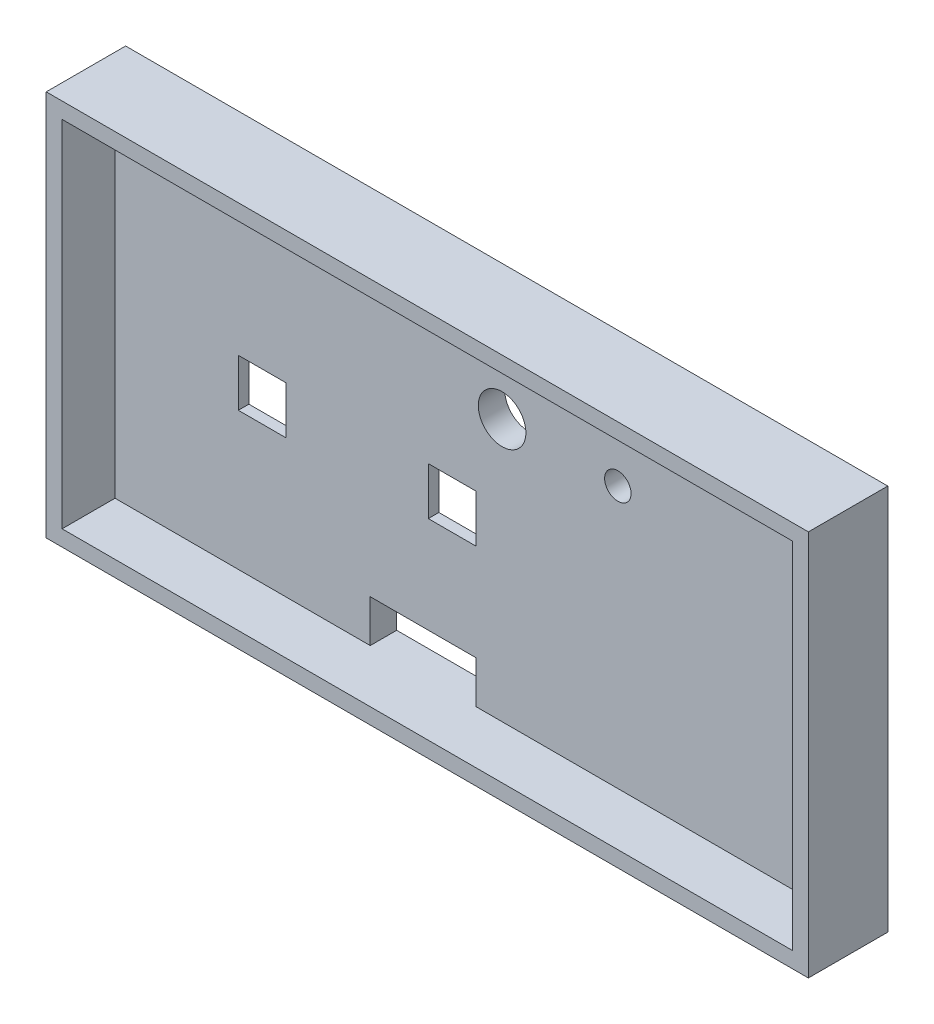
ISO-10303-21;
HEADER;
FILE_DESCRIPTION(('STEP AP214'),'2;1');
FILE_NAME('part.step','',(''),(''),'','','');
FILE_SCHEMA(('AUTOMOTIVE_DESIGN { 1 0 10303 214 1 1 1 1 }'));
ENDSEC;
DATA;
#1=APPLICATION_CONTEXT('core data for automotive mechanical design processes');
#2=APPLICATION_PROTOCOL_DEFINITION('international standard','automotive_design',2000,#1);
#3=PRODUCT_CONTEXT('',#1,'mechanical');
#4=PRODUCT('Part','Part','',(#3));
#5=PRODUCT_RELATED_PRODUCT_CATEGORY('part','',(#4));
#6=PRODUCT_DEFINITION_FORMATION('','',#4);
#7=PRODUCT_DEFINITION_CONTEXT('part definition',#1,'design');
#8=PRODUCT_DEFINITION('design','',#6,#7);
#9=PRODUCT_DEFINITION_SHAPE('','',#8);
#10=(LENGTH_UNIT() NAMED_UNIT(*) SI_UNIT(.MILLI.,.METRE.));
#11=(NAMED_UNIT(*) PLANE_ANGLE_UNIT() SI_UNIT($,.RADIAN.));
#12=(NAMED_UNIT(*) SI_UNIT($,.STERADIAN.) SOLID_ANGLE_UNIT());
#13=UNCERTAINTY_MEASURE_WITH_UNIT(LENGTH_MEASURE(1.E-05),#10,'distance_accuracy_value','');
#14=(GEOMETRIC_REPRESENTATION_CONTEXT(3) GLOBAL_UNCERTAINTY_ASSIGNED_CONTEXT((#13)) GLOBAL_UNIT_ASSIGNED_CONTEXT((#10,
#11,#12)) REPRESENTATION_CONTEXT('',''));
#15=CARTESIAN_POINT('',(0.,0.,0.));
#16=DIRECTION('',(0.,0.,1.));
#17=DIRECTION('',(1.,0.,0.));
#18=AXIS2_PLACEMENT_3D('',#15,#16,#17);
#19=CARTESIAN_POINT('',(0.,0.,5.));
#20=DIRECTION('',(0.,0.,-1.));
#21=DIRECTION('',(-1.,0.,0.));
#22=AXIS2_PLACEMENT_3D('',#19,#20,#21);
#23=PLANE('',#22);
#24=CARTESIAN_POINT('',(69.1285466758129,52.5065249926504,5.));
#25=DIRECTION('',(0.,0.,-1.));
#26=DIRECTION('',(-1.,0.,0.));
#27=AXIS2_PLACEMENT_3D('',#24,#25,#26);
#28=CIRCLE('',#27,4.50000000000001);
#29=CARTESIAN_POINT('',(64.6285466758129,52.5065249926504,5.));
#30=VERTEX_POINT('',#29);
#31=EDGE_CURVE('E422',#30,#30,#28,.T.);
#32=ORIENTED_EDGE('',*,*,#31,.T.);
#33=EDGE_LOOP('',(#32));
#34=FACE_BOUND('',#33,.T.);
#35=DIRECTION('',(-1.,0.,0.));
#36=VECTOR('',#35,1.);
#37=CARTESIAN_POINT('',(28.2933870874081,38.0413654042455,5.));
#38=LINE('',#37,#36);
#39=CARTESIAN_POINT('',(28.2933870874081,38.0413654042455,5.));
#40=VERTEX_POINT('',#39);
#41=CARTESIAN_POINT('',(19.293387087408,38.0413654042456,5.));
#42=VERTEX_POINT('',#41);
#43=EDGE_CURVE('E402',#40,#42,#38,.T.);
#44=ORIENTED_EDGE('',*,*,#43,.F.);
#45=DIRECTION('',(0.,1.,0.));
#46=VECTOR('',#45,1.);
#47=CARTESIAN_POINT('',(28.2933870874081,38.0413654042455,5.));
#48=LINE('',#47,#46);
#49=CARTESIAN_POINT('',(28.293387087408,29.0413654042456,5.));
#50=VERTEX_POINT('',#49);
#51=EDGE_CURVE('E399',#50,#40,#48,.T.);
#52=ORIENTED_EDGE('',*,*,#51,.F.);
#53=DIRECTION('',(1.,0.,0.));
#54=VECTOR('',#53,1.);
#55=CARTESIAN_POINT('',(28.293387087408,29.0413654042456,5.));
#56=LINE('',#55,#54);
#57=CARTESIAN_POINT('',(19.293387087408,29.0413654042456,5.));
#58=VERTEX_POINT('',#57);
#59=EDGE_CURVE('E408',#58,#50,#56,.T.);
#60=ORIENTED_EDGE('',*,*,#59,.F.);
#61=DIRECTION('',(0.,-1.,0.));
#62=VECTOR('',#61,1.);
#63=CARTESIAN_POINT('',(19.293387087408,38.0413654042456,5.));
#64=LINE('',#63,#62);
#65=EDGE_CURVE('E405',#42,#58,#64,.T.);
#66=ORIENTED_EDGE('',*,*,#65,.F.);
#67=EDGE_LOOP('',(#44,#52,#60,#66));
#68=FACE_BOUND('',#67,.T.);
#69=DIRECTION('',(1.,0.,0.));
#70=VECTOR('',#69,1.);
#71=CARTESIAN_POINT('',(0.,38.2637078079074,5.));
#72=LINE('',#71,#70);
#73=CARTESIAN_POINT('',(55.1883659810974,38.2637078079074,5.));
#74=VERTEX_POINT('',#73);
#75=CARTESIAN_POINT('',(64.1883659810974,38.2637078079074,5.));
#76=VERTEX_POINT('',#75);
#77=EDGE_CURVE('E451',#74,#76,#72,.T.);
#78=ORIENTED_EDGE('',*,*,#77,.T.);
#79=DIRECTION('',(0.,-1.,0.));
#80=VECTOR('',#79,1.);
#81=CARTESIAN_POINT('',(64.1883659810974,0.,5.));
#82=LINE('',#81,#80);
#83=CARTESIAN_POINT('',(64.1883659810974,29.2637078079074,5.));
#84=VERTEX_POINT('',#83);
#85=EDGE_CURVE('E49',#76,#84,#82,.T.);
#86=ORIENTED_EDGE('',*,*,#85,.T.);
#87=DIRECTION('',(-1.,0.,0.));
#88=VECTOR('',#87,1.);
#89=CARTESIAN_POINT('',(0.,29.2637078079074,5.));
#90=LINE('',#89,#88);
#91=CARTESIAN_POINT('',(55.1883659810974,29.2637078079074,5.));
#92=VERTEX_POINT('',#91);
#93=EDGE_CURVE('E445',#84,#92,#90,.T.);
#94=ORIENTED_EDGE('',*,*,#93,.T.);
#95=DIRECTION('',(0.,1.,0.));
#96=VECTOR('',#95,1.);
#97=CARTESIAN_POINT('',(55.1883659810974,0.,5.));
#98=LINE('',#97,#96);
#99=EDGE_CURVE('E448',#92,#74,#98,.T.);
#100=ORIENTED_EDGE('',*,*,#99,.T.);
#101=EDGE_LOOP('',(#78,#86,#94,#100));
#102=FACE_BOUND('',#101,.T.);
#103=CARTESIAN_POINT('',(90.9985466758129,52.5065249926504,5.));
#104=DIRECTION('',(0.,0.,-1.));
#105=DIRECTION('',(-1.,0.,0.));
#106=AXIS2_PLACEMENT_3D('',#103,#104,#105);
#107=CIRCLE('',#106,2.5);
#108=CARTESIAN_POINT('',(88.4985466758129,52.5065249926504,5.));
#109=VERTEX_POINT('',#108);
#110=EDGE_CURVE('E304',#109,#109,#107,.T.);
#111=ORIENTED_EDGE('',*,*,#110,.T.);
#112=EDGE_LOOP('',(#111));
#113=FACE_BOUND('',#112,.T.);
#114=DIRECTION('',(1.,0.,0.));
#115=VECTOR('',#114,1.);
#116=CARTESIAN_POINT('',(-7.,69.9953637180317,5.));
#117=LINE('',#116,#115);
#118=CARTESIAN_POINT('',(-4.,69.9953637180317,5.));
#119=VERTEX_POINT('',#118);
#120=CARTESIAN_POINT('',(134.,69.9953637180317,5.));
#121=VERTEX_POINT('',#120);
#122=EDGE_CURVE('E256',#119,#121,#117,.T.);
#123=ORIENTED_EDGE('',*,*,#122,.F.);
#124=DIRECTION('',(0.,1.,0.));
#125=VECTOR('',#124,1.);
#126=CARTESIAN_POINT('',(-4.,66.,5.));
#127=LINE('',#126,#125);
#128=CARTESIAN_POINT('',(-3.99999999999999,3.,5.));
#129=VERTEX_POINT('',#128);
#130=EDGE_CURVE('E292',#129,#119,#127,.T.);
#131=ORIENTED_EDGE('',*,*,#130,.F.);
#132=DIRECTION('',(1.,0.,0.));
#133=VECTOR('',#132,1.);
#134=CARTESIAN_POINT('',(3.,3.,5.));
#135=LINE('',#134,#133);
#136=CARTESIAN_POINT('',(44.2168533720593,3.,5.));
#137=VERTEX_POINT('',#136);
#138=EDGE_CURVE('E425',#129,#137,#135,.T.);
#139=ORIENTED_EDGE('',*,*,#138,.T.);
#140=DIRECTION('',(0.,-1.,0.));
#141=VECTOR('',#140,1.);
#142=CARTESIAN_POINT('',(44.2168533720593,3.,5.));
#143=LINE('',#142,#141);
#144=CARTESIAN_POINT('',(44.2168533720593,11.,5.));
#145=VERTEX_POINT('',#144);
#146=EDGE_CURVE('E273',#145,#137,#143,.T.);
#147=ORIENTED_EDGE('',*,*,#146,.F.);
#148=DIRECTION('',(-1.,0.,0.));
#149=VECTOR('',#148,1.);
#150=CARTESIAN_POINT('',(64.2168533720593,11.,5.));
#151=LINE('',#150,#149);
#152=CARTESIAN_POINT('',(64.2168533720593,11.,5.));
#153=VERTEX_POINT('',#152);
#154=EDGE_CURVE('E270',#153,#145,#151,.T.);
#155=ORIENTED_EDGE('',*,*,#154,.F.);
#156=DIRECTION('',(0.,1.,0.));
#157=VECTOR('',#156,1.);
#158=CARTESIAN_POINT('',(64.2168533720593,3.,5.));
#159=LINE('',#158,#157);
#160=CARTESIAN_POINT('',(64.2168533720593,3.,5.));
#161=VERTEX_POINT('',#160);
#162=EDGE_CURVE('E267',#161,#153,#159,.T.);
#163=ORIENTED_EDGE('',*,*,#162,.F.);
#164=CARTESIAN_POINT('',(134.,3.,5.));
#165=VERTEX_POINT('',#164);
#166=EDGE_CURVE('E429',#161,#165,#135,.T.);
#167=ORIENTED_EDGE('',*,*,#166,.T.);
#168=DIRECTION('',(0.,1.,0.));
#169=VECTOR('',#168,1.);
#170=CARTESIAN_POINT('',(134.,3.,5.));
#171=LINE('',#170,#169);
#172=EDGE_CURVE('E428',#165,#121,#171,.T.);
#173=ORIENTED_EDGE('',*,*,#172,.T.);
#174=EDGE_LOOP('',(#123,#131,#139,#147,#155,#163,#167,#173));
#175=FACE_BOUND('',#174,.T.);
#176=ADVANCED_FACE('F41',(#34,#68,#102,#113,#175),#23,.F.);
#177=CARTESIAN_POINT('',(-7.,69.9953637180317,15.));
#178=DIRECTION('',(0.,1.,0.));
#179=DIRECTION('',(0.,0.,1.));
#180=AXIS2_PLACEMENT_3D('',#177,#178,#179);
#181=PLANE('',#180);
#182=DIRECTION('',(0.,0.,-1.));
#183=VECTOR('',#182,1.);
#184=CARTESIAN_POINT('',(-4.,69.9953637180317,15.));
#185=LINE('',#184,#183);
#186=CARTESIAN_POINT('',(-4.,69.9953637180317,15.));
#187=VERTEX_POINT('',#186);
#188=EDGE_CURVE('E253',#187,#119,#185,.T.);
#189=ORIENTED_EDGE('',*,*,#188,.T.);
#190=ORIENTED_EDGE('',*,*,#122,.T.);
#191=DIRECTION('',(0.,0.,-1.));
#192=VECTOR('',#191,1.);
#193=CARTESIAN_POINT('',(134.,69.9953637180317,15.));
#194=LINE('',#193,#192);
#195=CARTESIAN_POINT('',(134.,69.9953637180317,15.));
#196=VERTEX_POINT('',#195);
#197=EDGE_CURVE('E246',#196,#121,#194,.T.);
#198=ORIENTED_EDGE('',*,*,#197,.F.);
#199=DIRECTION('',(1.,0.,0.));
#200=VECTOR('',#199,1.);
#201=CARTESIAN_POINT('',(-7.,69.9953637180317,15.));
#202=LINE('',#201,#200);
#203=EDGE_CURVE('E247',#187,#196,#202,.T.);
#204=ORIENTED_EDGE('',*,*,#203,.F.);
#205=EDGE_LOOP('',(#189,#190,#198,#204));
#206=FACE_BOUND('',#205,.T.);
#207=ADVANCED_FACE('F484',(#206),#181,.F.);
#208=CARTESIAN_POINT('',(0.,0.,15.));
#209=DIRECTION('',(0.,0.,-1.));
#210=DIRECTION('',(-1.,0.,0.));
#211=AXIS2_PLACEMENT_3D('',#208,#209,#210);
#212=PLANE('',#211);
#213=ORIENTED_EDGE('',*,*,#203,.T.);
#214=DIRECTION('',(0.,1.,0.));
#215=VECTOR('',#214,1.);
#216=CARTESIAN_POINT('',(134.,3.,15.));
#217=LINE('',#216,#215);
#218=CARTESIAN_POINT('',(134.,3.,15.));
#219=VERTEX_POINT('',#218);
#220=EDGE_CURVE('E433',#219,#196,#217,.T.);
#221=ORIENTED_EDGE('',*,*,#220,.F.);
#222=DIRECTION('',(1.,0.,0.));
#223=VECTOR('',#222,1.);
#224=CARTESIAN_POINT('',(3.,3.,15.));
#225=LINE('',#224,#223);
#226=CARTESIAN_POINT('',(-3.99999999999999,3.,15.));
#227=VERTEX_POINT('',#226);
#228=EDGE_CURVE('E61',#227,#219,#225,.T.);
#229=ORIENTED_EDGE('',*,*,#228,.F.);
#230=DIRECTION('',(0.,1.,0.));
#231=VECTOR('',#230,1.);
#232=CARTESIAN_POINT('',(-4.,66.,15.));
#233=LINE('',#232,#231);
#234=EDGE_CURVE('E56',#227,#187,#233,.T.);
#235=ORIENTED_EDGE('',*,*,#234,.T.);
#236=EDGE_LOOP('',(#213,#221,#229,#235));
#237=FACE_BOUND('',#236,.T.);
#238=DIRECTION('',(0.,1.,0.));
#239=VECTOR('',#238,1.);
#240=CARTESIAN_POINT('',(137.,0.,15.));
#241=LINE('',#240,#239);
#242=CARTESIAN_POINT('',(137.,0.,15.));
#243=VERTEX_POINT('',#242);
#244=CARTESIAN_POINT('',(137.,73.,15.));
#245=VERTEX_POINT('',#244);
#246=EDGE_CURVE('E226',#243,#245,#241,.T.);
#247=ORIENTED_EDGE('',*,*,#246,.T.);
#248=DIRECTION('',(-1.,0.,0.));
#249=VECTOR('',#248,1.);
#250=CARTESIAN_POINT('',(-7.,73.,15.));
#251=LINE('',#250,#249);
#252=CARTESIAN_POINT('',(-7.,73.,15.));
#253=VERTEX_POINT('',#252);
#254=EDGE_CURVE('E230',#245,#253,#251,.T.);
#255=ORIENTED_EDGE('',*,*,#254,.T.);
#256=DIRECTION('',(0.,-1.,0.));
#257=VECTOR('',#256,1.);
#258=CARTESIAN_POINT('',(-7.,66.,15.));
#259=LINE('',#258,#257);
#260=CARTESIAN_POINT('',(-7.,0.,15.));
#261=VERTEX_POINT('',#260);
#262=EDGE_CURVE('E293',#253,#261,#259,.T.);
#263=ORIENTED_EDGE('',*,*,#262,.T.);
#264=DIRECTION('',(1.,0.,0.));
#265=VECTOR('',#264,1.);
#266=CARTESIAN_POINT('',(0.,0.,15.));
#267=LINE('',#266,#265);
#268=EDGE_CURVE('E231',#261,#243,#267,.T.);
#269=ORIENTED_EDGE('',*,*,#268,.T.);
#270=EDGE_LOOP('',(#247,#255,#263,#269));
#271=FACE_BOUND('',#270,.T.);
#272=ADVANCED_FACE('F228',(#237,#271),#212,.F.);
#273=CARTESIAN_POINT('',(-4.,66.,15.));
#274=DIRECTION('',(-1.,0.,0.));
#275=DIRECTION('',(0.,-1.,0.));
#276=AXIS2_PLACEMENT_3D('',#273,#274,#275);
#277=PLANE('',#276);
#278=ORIENTED_EDGE('',*,*,#130,.T.);
#279=ORIENTED_EDGE('',*,*,#188,.F.);
#280=ORIENTED_EDGE('',*,*,#234,.F.);
#281=DIRECTION('',(0.,0.,-1.));
#282=VECTOR('',#281,1.);
#283=CARTESIAN_POINT('',(-3.99999999999999,3.,15.));
#284=LINE('',#283,#282);
#285=EDGE_CURVE('E289',#227,#129,#284,.T.);
#286=ORIENTED_EDGE('',*,*,#285,.T.);
#287=EDGE_LOOP('',(#278,#279,#280,#286));
#288=FACE_BOUND('',#287,.T.);
#289=ADVANCED_FACE('F507',(#288),#277,.F.);
#290=CARTESIAN_POINT('',(0.,0.,3.));
#291=DIRECTION('',(0.,0.,1.));
#292=DIRECTION('',(1.,0.,0.));
#293=AXIS2_PLACEMENT_3D('',#290,#291,#292);
#294=PLANE('',#293);
#295=DIRECTION('',(0.,1.,0.));
#296=VECTOR('',#295,1.);
#297=CARTESIAN_POINT('',(51.4374572495873,41.5127990763973,3.));
#298=LINE('',#297,#296);
#299=CARTESIAN_POINT('',(51.4374572495873,25.5127990763973,3.));
#300=VERTEX_POINT('',#299);
#301=CARTESIAN_POINT('',(51.4374572495873,41.5127990763973,3.));
#302=VERTEX_POINT('',#301);
#303=EDGE_CURVE('E330',#300,#302,#298,.T.);
#304=ORIENTED_EDGE('',*,*,#303,.T.);
#305=DIRECTION('',(1.,0.,0.));
#306=VECTOR('',#305,1.);
#307=CARTESIAN_POINT('',(51.4374572495873,41.5127990763973,3.));
#308=LINE('',#307,#306);
#309=CARTESIAN_POINT('',(67.4374572495873,41.5127990763973,3.));
#310=VERTEX_POINT('',#309);
#311=EDGE_CURVE('E333',#302,#310,#308,.T.);
#312=ORIENTED_EDGE('',*,*,#311,.T.);
#313=DIRECTION('',(0.,-1.,0.));
#314=VECTOR('',#313,1.);
#315=CARTESIAN_POINT('',(67.4374572495873,41.5127990763973,3.));
#316=LINE('',#315,#314);
#317=CARTESIAN_POINT('',(67.4374572495873,25.5127990763973,3.));
#318=VERTEX_POINT('',#317);
#319=EDGE_CURVE('E337',#310,#318,#316,.T.);
#320=ORIENTED_EDGE('',*,*,#319,.T.);
#321=DIRECTION('',(-1.,0.,0.));
#322=VECTOR('',#321,1.);
#323=CARTESIAN_POINT('',(51.4374572495873,25.5127990763973,3.));
#324=LINE('',#323,#322);
#325=EDGE_CURVE('E340',#318,#300,#324,.T.);
#326=ORIENTED_EDGE('',*,*,#325,.T.);
#327=EDGE_LOOP('',(#304,#312,#320,#326));
#328=FACE_BOUND('',#327,.T.);
#329=DIRECTION('',(0.,-1.,0.));
#330=VECTOR('',#329,1.);
#331=CARTESIAN_POINT('',(64.1883659810974,38.2637078079074,3.));
#332=LINE('',#331,#330);
#333=CARTESIAN_POINT('',(64.1883659810974,38.2637078079074,3.));
#334=VERTEX_POINT('',#333);
#335=CARTESIAN_POINT('',(64.1883659810974,29.2637078079074,3.));
#336=VERTEX_POINT('',#335);
#337=EDGE_CURVE('E307',#334,#336,#332,.T.);
#338=ORIENTED_EDGE('',*,*,#337,.F.);
#339=DIRECTION('',(1.,0.,0.));
#340=VECTOR('',#339,1.);
#341=CARTESIAN_POINT('',(64.1883659810974,38.2637078079074,3.));
#342=LINE('',#341,#340);
#343=CARTESIAN_POINT('',(55.1883659810974,38.2637078079074,3.));
#344=VERTEX_POINT('',#343);
#345=EDGE_CURVE('E317',#344,#334,#342,.T.);
#346=ORIENTED_EDGE('',*,*,#345,.F.);
#347=DIRECTION('',(0.,1.,0.));
#348=VECTOR('',#347,1.);
#349=CARTESIAN_POINT('',(55.1883659810974,38.2637078079074,3.));
#350=LINE('',#349,#348);
#351=CARTESIAN_POINT('',(55.1883659810974,29.2637078079074,3.));
#352=VERTEX_POINT('',#351);
#353=EDGE_CURVE('E315',#352,#344,#350,.T.);
#354=ORIENTED_EDGE('',*,*,#353,.F.);
#355=DIRECTION('',(-1.,0.,0.));
#356=VECTOR('',#355,1.);
#357=CARTESIAN_POINT('',(64.1883659810974,29.2637078079074,3.));
#358=LINE('',#357,#356);
#359=EDGE_CURVE('E312',#336,#352,#358,.T.);
#360=ORIENTED_EDGE('',*,*,#359,.F.);
#361=EDGE_LOOP('',(#338,#346,#354,#360));
#362=FACE_BOUND('',#361,.T.);
#363=ADVANCED_FACE('F468',(#328,#362),#294,.F.);
#364=CARTESIAN_POINT('',(28.2933870874081,38.0413654042455,2.5));
#365=DIRECTION('',(1.,0.,0.));
#366=DIRECTION('',(0.,1.,0.));
#367=AXIS2_PLACEMENT_3D('',#364,#365,#366);
#368=PLANE('',#367);
#369=DIRECTION('',(0.,1.,0.));
#370=VECTOR('',#369,1.);
#371=CARTESIAN_POINT('',(28.2933870874081,38.0413654042455,3.));
#372=LINE('',#371,#370);
#373=CARTESIAN_POINT('',(28.2933870874081,29.0413654042456,3.));
#374=VERTEX_POINT('',#373);
#375=CARTESIAN_POINT('',(28.2933870874081,38.0413654042455,3.));
#376=VERTEX_POINT('',#375);
#377=EDGE_CURVE('E397',#374,#376,#372,.T.);
#378=ORIENTED_EDGE('',*,*,#377,.F.);
#379=DIRECTION('',(0.,0.,1.));
#380=VECTOR('',#379,1.);
#381=CARTESIAN_POINT('',(28.293387087408,29.0413654042456,2.5));
#382=LINE('',#381,#380);
#383=EDGE_CURVE('E412',#374,#50,#382,.T.);
#384=ORIENTED_EDGE('',*,*,#383,.T.);
#385=ORIENTED_EDGE('',*,*,#51,.T.);
#386=DIRECTION('',(0.,0.,1.));
#387=VECTOR('',#386,1.);
#388=CARTESIAN_POINT('',(28.2933870874081,38.0413654042455,2.5));
#389=LINE('',#388,#387);
#390=EDGE_CURVE('E411',#376,#40,#389,.T.);
#391=ORIENTED_EDGE('',*,*,#390,.F.);
#392=EDGE_LOOP('',(#378,#384,#385,#391));
#393=FACE_BOUND('',#392,.T.);
#394=ADVANCED_FACE('F753',(#393),#368,.F.);
#395=CARTESIAN_POINT('',(28.293387087408,29.0413654042456,2.5));
#396=DIRECTION('',(0.,-1.,0.));
#397=DIRECTION('',(0.,0.,-1.));
#398=AXIS2_PLACEMENT_3D('',#395,#396,#397);
#399=PLANE('',#398);
#400=DIRECTION('',(1.,0.,0.));
#401=VECTOR('',#400,1.);
#402=CARTESIAN_POINT('',(28.293387087408,29.0413654042456,3.));
#403=LINE('',#402,#401);
#404=CARTESIAN_POINT('',(19.293387087408,29.0413654042456,3.));
#405=VERTEX_POINT('',#404);
#406=EDGE_CURVE('E395',#405,#374,#403,.T.);
#407=ORIENTED_EDGE('',*,*,#406,.F.);
#408=DIRECTION('',(0.,0.,1.));
#409=VECTOR('',#408,1.);
#410=CARTESIAN_POINT('',(19.293387087408,29.0413654042456,2.5));
#411=LINE('',#410,#409);
#412=EDGE_CURVE('E415',#405,#58,#411,.T.);
#413=ORIENTED_EDGE('',*,*,#412,.T.);
#414=ORIENTED_EDGE('',*,*,#59,.T.);
#415=ORIENTED_EDGE('',*,*,#383,.F.);
#416=EDGE_LOOP('',(#407,#413,#414,#415));
#417=FACE_BOUND('',#416,.T.);
#418=ADVANCED_FACE('F743',(#417),#399,.F.);
#419=CARTESIAN_POINT('',(19.293387087408,38.0413654042456,2.5));
#420=DIRECTION('',(-1.,0.,0.));
#421=DIRECTION('',(0.,-1.,0.));
#422=AXIS2_PLACEMENT_3D('',#419,#420,#421);
#423=PLANE('',#422);
#424=DIRECTION('',(0.,-1.,0.));
#425=VECTOR('',#424,1.);
#426=CARTESIAN_POINT('',(19.293387087408,38.0413654042456,3.));
#427=LINE('',#426,#425);
#428=CARTESIAN_POINT('',(19.293387087408,38.0413654042456,3.));
#429=VERTEX_POINT('',#428);
#430=EDGE_CURVE('E387',#429,#405,#427,.T.);
#431=ORIENTED_EDGE('',*,*,#430,.F.);
#432=DIRECTION('',(0.,0.,1.));
#433=VECTOR('',#432,1.);
#434=CARTESIAN_POINT('',(19.293387087408,38.0413654042456,2.5));
#435=LINE('',#434,#433);
#436=EDGE_CURVE('E417',#429,#42,#435,.T.);
#437=ORIENTED_EDGE('',*,*,#436,.T.);
#438=ORIENTED_EDGE('',*,*,#65,.T.);
#439=ORIENTED_EDGE('',*,*,#412,.F.);
#440=EDGE_LOOP('',(#431,#437,#438,#439));
#441=FACE_BOUND('',#440,.T.);
#442=ADVANCED_FACE('F733',(#441),#423,.F.);
#443=CARTESIAN_POINT('',(28.2933870874081,38.0413654042455,2.5));
#444=DIRECTION('',(0.,1.,0.));
#445=DIRECTION('',(-1.,0.,0.));
#446=AXIS2_PLACEMENT_3D('',#443,#444,#445);
#447=PLANE('',#446);
#448=DIRECTION('',(-1.,0.,0.));
#449=VECTOR('',#448,1.);
#450=CARTESIAN_POINT('',(28.2933870874081,38.0413654042455,3.));
#451=LINE('',#450,#449);
#452=EDGE_CURVE('E441',#376,#429,#451,.T.);
#453=ORIENTED_EDGE('',*,*,#452,.F.);
#454=ORIENTED_EDGE('',*,*,#390,.T.);
#455=ORIENTED_EDGE('',*,*,#43,.T.);
#456=ORIENTED_EDGE('',*,*,#436,.F.);
#457=EDGE_LOOP('',(#453,#454,#455,#456));
#458=FACE_BOUND('',#457,.T.);
#459=ADVANCED_FACE('F510',(#458),#447,.F.);
#460=CARTESIAN_POINT('',(0.,0.,0.));
#461=DIRECTION('',(0.,0.,-1.));
#462=DIRECTION('',(-1.,0.,0.));
#463=AXIS2_PLACEMENT_3D('',#460,#461,#462);
#464=PLANE('',#463);
#465=DIRECTION('',(-1.,0.,0.));
#466=VECTOR('',#465,1.);
#467=CARTESIAN_POINT('',(62.8318833349666,3.,0.));
#468=LINE('',#467,#466);
#469=CARTESIAN_POINT('',(64.2168533720593,3.,0.));
#470=VERTEX_POINT('',#469);
#471=CARTESIAN_POINT('',(44.2168533720593,3.,0.));
#472=VERTEX_POINT('',#471);
#473=EDGE_CURVE('E423',#470,#472,#468,.T.);
#474=ORIENTED_EDGE('',*,*,#473,.F.);
#475=DIRECTION('',(0.,-1.,0.));
#476=VECTOR('',#475,1.);
#477=CARTESIAN_POINT('',(64.2168533720593,0.,0.));
#478=LINE('',#477,#476);
#479=CARTESIAN_POINT('',(64.2168533720593,11.,0.));
#480=VERTEX_POINT('',#479);
#481=EDGE_CURVE('E286',#480,#470,#478,.T.);
#482=ORIENTED_EDGE('',*,*,#481,.F.);
#483=DIRECTION('',(1.,0.,0.));
#484=VECTOR('',#483,1.);
#485=CARTESIAN_POINT('',(0.,11.,0.));
#486=LINE('',#485,#484);
#487=CARTESIAN_POINT('',(44.2168533720593,11.,0.));
#488=VERTEX_POINT('',#487);
#489=EDGE_CURVE('E11',#488,#480,#486,.T.);
#490=ORIENTED_EDGE('',*,*,#489,.F.);
#491=DIRECTION('',(0.,1.,0.));
#492=VECTOR('',#491,1.);
#493=CARTESIAN_POINT('',(44.2168533720593,0.,0.));
#494=LINE('',#493,#492);
#495=EDGE_CURVE('E279',#472,#488,#494,.T.);
#496=ORIENTED_EDGE('',*,*,#495,.F.);
#497=EDGE_LOOP('',(#474,#482,#490,#496));
#498=FACE_BOUND('',#497,.T.);
#499=CARTESIAN_POINT('',(90.9985466758129,52.5065249926504,0.));
#500=DIRECTION('',(0.,0.,-1.));
#501=DIRECTION('',(-1.,0.,0.));
#502=AXIS2_PLACEMENT_3D('',#499,#500,#501);
#503=CIRCLE('',#502,2.5);
#504=CARTESIAN_POINT('',(88.4985466758129,52.5065249926504,0.));
#505=VERTEX_POINT('',#504);
#506=EDGE_CURVE('E303',#505,#505,#503,.T.);
#507=ORIENTED_EDGE('',*,*,#506,.F.);
#508=EDGE_LOOP('',(#507));
#509=FACE_BOUND('',#508,.T.);
#510=DIRECTION('',(0.,1.,0.));
#511=VECTOR('',#510,1.);
#512=CARTESIAN_POINT('',(51.4374572495873,41.5127990763973,0.));
#513=LINE('',#512,#511);
#514=CARTESIAN_POINT('',(51.4374572495873,25.5127990763973,0.));
#515=VERTEX_POINT('',#514);
#516=CARTESIAN_POINT('',(51.4374572495873,41.5127990763973,0.));
#517=VERTEX_POINT('',#516);
#518=EDGE_CURVE('E323',#515,#517,#513,.T.);
#519=ORIENTED_EDGE('',*,*,#518,.F.);
#520=DIRECTION('',(-1.,0.,0.));
#521=VECTOR('',#520,1.);
#522=CARTESIAN_POINT('',(51.4374572495873,25.5127990763973,0.));
#523=LINE('',#522,#521);
#524=CARTESIAN_POINT('',(67.4374572495873,25.5127990763973,0.));
#525=VERTEX_POINT('',#524);
#526=EDGE_CURVE('E334',#525,#515,#523,.T.);
#527=ORIENTED_EDGE('',*,*,#526,.F.);
#528=DIRECTION('',(0.,-1.,0.));
#529=VECTOR('',#528,1.);
#530=CARTESIAN_POINT('',(67.4374572495873,41.5127990763973,0.));
#531=LINE('',#530,#529);
#532=CARTESIAN_POINT('',(67.4374572495873,41.5127990763973,0.));
#533=VERTEX_POINT('',#532);
#534=EDGE_CURVE('E348',#533,#525,#531,.T.);
#535=ORIENTED_EDGE('',*,*,#534,.F.);
#536=DIRECTION('',(1.,0.,0.));
#537=VECTOR('',#536,1.);
#538=CARTESIAN_POINT('',(51.4374572495873,41.5127990763973,0.));
#539=LINE('',#538,#537);
#540=EDGE_CURVE('E345',#517,#533,#539,.T.);
#541=ORIENTED_EDGE('',*,*,#540,.F.);
#542=EDGE_LOOP('',(#519,#527,#535,#541));
#543=FACE_BOUND('',#542,.T.);
#544=DIRECTION('',(0.,-1.,0.));
#545=VECTOR('',#544,1.);
#546=CARTESIAN_POINT('',(31.7648207595599,41.5127990763973,0.));
#547=LINE('',#546,#545);
#548=CARTESIAN_POINT('',(31.7648207595599,41.5127990763973,0.));
#549=VERTEX_POINT('',#548);
#550=CARTESIAN_POINT('',(31.7648207595599,25.5127990763976,0.));
#551=VERTEX_POINT('',#550);
#552=EDGE_CURVE('E355',#549,#551,#547,.T.);
#553=ORIENTED_EDGE('',*,*,#552,.F.);
#554=DIRECTION('',(1.,0.,0.));
#555=VECTOR('',#554,1.);
#556=CARTESIAN_POINT('',(31.7648207595599,41.5127990763973,0.));
#557=LINE('',#556,#555);
#558=CARTESIAN_POINT('',(15.7648207595599,41.5127990763973,0.));
#559=VERTEX_POINT('',#558);
#560=EDGE_CURVE('E366',#559,#549,#557,.T.);
#561=ORIENTED_EDGE('',*,*,#560,.F.);
#562=DIRECTION('',(0.,1.,0.));
#563=VECTOR('',#562,1.);
#564=CARTESIAN_POINT('',(15.7648207595599,41.5127990763973,0.));
#565=LINE('',#564,#563);
#566=CARTESIAN_POINT('',(15.7648207595599,25.5127990763976,0.));
#567=VERTEX_POINT('',#566);
#568=EDGE_CURVE('E380',#567,#559,#565,.T.);
#569=ORIENTED_EDGE('',*,*,#568,.F.);
#570=DIRECTION('',(-1.,0.,0.));
#571=VECTOR('',#570,1.);
#572=CARTESIAN_POINT('',(31.7648207595599,25.5127990763976,0.));
#573=LINE('',#572,#571);
#574=EDGE_CURVE('E377',#551,#567,#573,.T.);
#575=ORIENTED_EDGE('',*,*,#574,.F.);
#576=EDGE_LOOP('',(#553,#561,#569,#575));
#577=FACE_BOUND('',#576,.T.);
#578=CARTESIAN_POINT('',(69.1285466758129,52.5065249926504,0.));
#579=DIRECTION('',(0.,0.,-1.));
#580=DIRECTION('',(-1.,0.,0.));
#581=AXIS2_PLACEMENT_3D('',#578,#579,#580);
#582=CIRCLE('',#581,4.50000000000001);
#583=CARTESIAN_POINT('',(64.6285466758129,52.5065249926504,0.));
#584=VERTEX_POINT('',#583);
#585=EDGE_CURVE('E414',#584,#584,#582,.T.);
#586=ORIENTED_EDGE('',*,*,#585,.F.);
#587=EDGE_LOOP('',(#586));
#588=FACE_BOUND('',#587,.T.);
#589=DIRECTION('',(1.,0.,0.));
#590=VECTOR('',#589,1.);
#591=CARTESIAN_POINT('',(0.,0.,0.));
#592=LINE('',#591,#590);
#593=CARTESIAN_POINT('',(-7.,0.,0.));
#594=VERTEX_POINT('',#593);
#595=CARTESIAN_POINT('',(137.,0.,0.));
#596=VERTEX_POINT('',#595);
#597=EDGE_CURVE('E436',#594,#596,#592,.T.);
#598=ORIENTED_EDGE('',*,*,#597,.F.);
#599=DIRECTION('',(0.,-1.,0.));
#600=VECTOR('',#599,1.);
#601=CARTESIAN_POINT('',(-7.,66.,0.));
#602=LINE('',#601,#600);
#603=CARTESIAN_POINT('',(-7.,73.,0.));
#604=VERTEX_POINT('',#603);
#605=EDGE_CURVE('E296',#604,#594,#602,.T.);
#606=ORIENTED_EDGE('',*,*,#605,.F.);
#607=DIRECTION('',(-1.,0.,0.));
#608=VECTOR('',#607,1.);
#609=CARTESIAN_POINT('',(-7.,73.,0.));
#610=LINE('',#609,#608);
#611=CARTESIAN_POINT('',(137.,73.,0.));
#612=VERTEX_POINT('',#611);
#613=EDGE_CURVE('E265',#612,#604,#610,.T.);
#614=ORIENTED_EDGE('',*,*,#613,.F.);
#615=DIRECTION('',(0.,1.,0.));
#616=VECTOR('',#615,1.);
#617=CARTESIAN_POINT('',(137.,0.,0.));
#618=LINE('',#617,#616);
#619=EDGE_CURVE('E251',#596,#612,#618,.T.);
#620=ORIENTED_EDGE('',*,*,#619,.F.);
#621=EDGE_LOOP('',(#598,#606,#614,#620));
#622=FACE_BOUND('',#621,.T.);
#623=ADVANCED_FACE('F508',(#498,#509,#543,#577,#588,#622),#464,.T.);
#624=CARTESIAN_POINT('',(0.,0.,15.));
#625=DIRECTION('',(0.,1.,0.));
#626=DIRECTION('',(0.,0.,1.));
#627=AXIS2_PLACEMENT_3D('',#624,#625,#626);
#628=PLANE('',#627);
#629=ORIENTED_EDGE('',*,*,#268,.F.);
#630=DIRECTION('',(0.,0.,1.));
#631=VECTOR('',#630,1.);
#632=CARTESIAN_POINT('',(-7.,0.,0.));
#633=LINE('',#632,#631);
#634=EDGE_CURVE('E300',#594,#261,#633,.T.);
#635=ORIENTED_EDGE('',*,*,#634,.F.);
#636=ORIENTED_EDGE('',*,*,#597,.T.);
#637=DIRECTION('',(0.,0.,-1.));
#638=VECTOR('',#637,1.);
#639=CARTESIAN_POINT('',(137.,0.,15.));
#640=LINE('',#639,#638);
#641=EDGE_CURVE('E236',#243,#596,#640,.T.);
#642=ORIENTED_EDGE('',*,*,#641,.F.);
#643=EDGE_LOOP('',(#629,#635,#636,#642));
#644=FACE_BOUND('',#643,.T.);
#645=ADVANCED_FACE('F43',(#644),#628,.F.);
#646=CARTESIAN_POINT('',(137.,0.,15.));
#647=DIRECTION('',(-1.,0.,0.));
#648=DIRECTION('',(0.,0.,1.));
#649=AXIS2_PLACEMENT_3D('',#646,#647,#648);
#650=PLANE('',#649);
#651=ORIENTED_EDGE('',*,*,#619,.T.);
#652=DIRECTION('',(0.,0.,-1.));
#653=VECTOR('',#652,1.);
#654=CARTESIAN_POINT('',(137.,73.,0.));
#655=LINE('',#654,#653);
#656=EDGE_CURVE('E243',#245,#612,#655,.T.);
#657=ORIENTED_EDGE('',*,*,#656,.F.);
#658=ORIENTED_EDGE('',*,*,#246,.F.);
#659=ORIENTED_EDGE('',*,*,#641,.T.);
#660=EDGE_LOOP('',(#651,#657,#658,#659));
#661=FACE_BOUND('',#660,.T.);
#662=ADVANCED_FACE('F249',(#661),#650,.F.);
#663=CARTESIAN_POINT('',(134.,3.,5.));
#664=DIRECTION('',(1.,0.,0.));
#665=DIRECTION('',(0.,0.,-1.));
#666=AXIS2_PLACEMENT_3D('',#663,#664,#665);
#667=PLANE('',#666);
#668=ORIENTED_EDGE('',*,*,#220,.T.);
#669=ORIENTED_EDGE('',*,*,#197,.T.);
#670=ORIENTED_EDGE('',*,*,#172,.F.);
#671=DIRECTION('',(0.,0.,1.));
#672=VECTOR('',#671,1.);
#673=CARTESIAN_POINT('',(134.,3.,5.));
#674=LINE('',#673,#672);
#675=EDGE_CURVE('E431',#165,#219,#674,.T.);
#676=ORIENTED_EDGE('',*,*,#675,.T.);
#677=EDGE_LOOP('',(#668,#669,#670,#676));
#678=FACE_BOUND('',#677,.T.);
#679=ADVANCED_FACE('F497',(#678),#667,.F.);
#680=CARTESIAN_POINT('',(3.,3.,5.));
#681=DIRECTION('',(0.,-1.,0.));
#682=DIRECTION('',(0.,0.,-1.));
#683=AXIS2_PLACEMENT_3D('',#680,#681,#682);
#684=PLANE('',#683);
#685=ORIENTED_EDGE('',*,*,#166,.F.);
#686=DIRECTION('',(0.,0.,1.));
#687=VECTOR('',#686,1.);
#688=CARTESIAN_POINT('',(64.2168533720593,3.,-5.));
#689=LINE('',#688,#687);
#690=EDGE_CURVE('E277',#470,#161,#689,.T.);
#691=ORIENTED_EDGE('',*,*,#690,.F.);
#692=ORIENTED_EDGE('',*,*,#473,.T.);
#693=DIRECTION('',(0.,0.,1.));
#694=VECTOR('',#693,1.);
#695=CARTESIAN_POINT('',(44.2168533720593,3.,-5.));
#696=LINE('',#695,#694);
#697=EDGE_CURVE('E280',#472,#137,#696,.T.);
#698=ORIENTED_EDGE('',*,*,#697,.T.);
#699=ORIENTED_EDGE('',*,*,#138,.F.);
#700=ORIENTED_EDGE('',*,*,#285,.F.);
#701=ORIENTED_EDGE('',*,*,#228,.T.);
#702=ORIENTED_EDGE('',*,*,#675,.F.);
#703=EDGE_LOOP('',(#685,#691,#692,#698,#699,#700,#701,#702));
#704=FACE_BOUND('',#703,.T.);
#705=ADVANCED_FACE('F500',(#704),#684,.F.);
#706=CARTESIAN_POINT('',(69.1285466758129,52.5065249926504,10.));
#707=DIRECTION('',(0.,0.,-1.));
#708=DIRECTION('',(-1.,0.,0.));
#709=AXIS2_PLACEMENT_3D('',#706,#707,#708);
#710=CYLINDRICAL_SURFACE('',#709,4.50000000000001);
#711=ORIENTED_EDGE('',*,*,#585,.T.);
#712=EDGE_LOOP('',(#711));
#713=FACE_BOUND('',#712,.T.);
#714=ORIENTED_EDGE('',*,*,#31,.F.);
#715=EDGE_LOOP('',(#714));
#716=FACE_BOUND('',#715,.T.);
#717=ADVANCED_FACE('F495',(#713,#716),#710,.F.);
#718=CARTESIAN_POINT('',(0.,0.,3.));
#719=DIRECTION('',(0.,0.,-1.));
#720=DIRECTION('',(-1.,0.,0.));
#721=AXIS2_PLACEMENT_3D('',#718,#719,#720);
#722=PLANE('',#721);
#723=DIRECTION('',(0.,-1.,0.));
#724=VECTOR('',#723,1.);
#725=CARTESIAN_POINT('',(31.7648207595599,41.5127990763973,3.));
#726=LINE('',#725,#724);
#727=CARTESIAN_POINT('',(31.7648207595599,41.5127990763973,3.));
#728=VERTEX_POINT('',#727);
#729=CARTESIAN_POINT('',(31.7648207595599,25.5127990763976,3.));
#730=VERTEX_POINT('',#729);
#731=EDGE_CURVE('E362',#728,#730,#726,.T.);
#732=ORIENTED_EDGE('',*,*,#731,.T.);
#733=DIRECTION('',(-1.,0.,0.));
#734=VECTOR('',#733,1.);
#735=CARTESIAN_POINT('',(31.7648207595599,25.5127990763976,3.));
#736=LINE('',#735,#734);
#737=CARTESIAN_POINT('',(15.7648207595599,25.5127990763976,3.));
#738=VERTEX_POINT('',#737);
#739=EDGE_CURVE('E365',#730,#738,#736,.T.);
#740=ORIENTED_EDGE('',*,*,#739,.T.);
#741=DIRECTION('',(0.,1.,0.));
#742=VECTOR('',#741,1.);
#743=CARTESIAN_POINT('',(15.7648207595599,41.5127990763973,3.));
#744=LINE('',#743,#742);
#745=CARTESIAN_POINT('',(15.7648207595599,41.5127990763973,3.));
#746=VERTEX_POINT('',#745);
#747=EDGE_CURVE('E369',#738,#746,#744,.T.);
#748=ORIENTED_EDGE('',*,*,#747,.T.);
#749=DIRECTION('',(1.,0.,0.));
#750=VECTOR('',#749,1.);
#751=CARTESIAN_POINT('',(31.7648207595599,41.5127990763973,3.));
#752=LINE('',#751,#750);
#753=EDGE_CURVE('E372',#746,#728,#752,.T.);
#754=ORIENTED_EDGE('',*,*,#753,.T.);
#755=EDGE_LOOP('',(#732,#740,#748,#754));
#756=FACE_BOUND('',#755,.T.);
#757=ORIENTED_EDGE('',*,*,#377,.T.);
#758=ORIENTED_EDGE('',*,*,#452,.T.);
#759=ORIENTED_EDGE('',*,*,#430,.T.);
#760=ORIENTED_EDGE('',*,*,#406,.T.);
#761=EDGE_LOOP('',(#757,#758,#759,#760));
#762=FACE_BOUND('',#761,.T.);
#763=ADVANCED_FACE('F680',(#756,#762),#722,.T.);
#764=CARTESIAN_POINT('',(31.7648207595599,41.5127990763973,3.));
#765=DIRECTION('',(1.,0.,0.));
#766=DIRECTION('',(0.,0.,-1.));
#767=AXIS2_PLACEMENT_3D('',#764,#765,#766);
#768=PLANE('',#767);
#769=ORIENTED_EDGE('',*,*,#552,.T.);
#770=DIRECTION('',(0.,0.,-1.));
#771=VECTOR('',#770,1.);
#772=CARTESIAN_POINT('',(31.7648207595599,25.5127990763976,3.));
#773=LINE('',#772,#771);
#774=EDGE_CURVE('E375',#730,#551,#773,.T.);
#775=ORIENTED_EDGE('',*,*,#774,.F.);
#776=ORIENTED_EDGE('',*,*,#731,.F.);
#777=DIRECTION('',(0.,0.,-1.));
#778=VECTOR('',#777,1.);
#779=CARTESIAN_POINT('',(31.7648207595599,41.5127990763973,3.));
#780=LINE('',#779,#778);
#781=EDGE_CURVE('E385',#728,#549,#780,.T.);
#782=ORIENTED_EDGE('',*,*,#781,.T.);
#783=EDGE_LOOP('',(#769,#775,#776,#782));
#784=FACE_BOUND('',#783,.T.);
#785=ADVANCED_FACE('F670',(#784),#768,.F.);
#786=CARTESIAN_POINT('',(31.7648207595599,41.5127990763973,3.));
#787=DIRECTION('',(0.,1.,0.));
#788=DIRECTION('',(0.,0.,1.));
#789=AXIS2_PLACEMENT_3D('',#786,#787,#788);
#790=PLANE('',#789);
#791=ORIENTED_EDGE('',*,*,#560,.T.);
#792=ORIENTED_EDGE('',*,*,#781,.F.);
#793=ORIENTED_EDGE('',*,*,#753,.F.);
#794=DIRECTION('',(0.,0.,-1.));
#795=VECTOR('',#794,1.);
#796=CARTESIAN_POINT('',(15.7648207595599,41.5127990763973,3.));
#797=LINE('',#796,#795);
#798=EDGE_CURVE('E388',#746,#559,#797,.T.);
#799=ORIENTED_EDGE('',*,*,#798,.T.);
#800=EDGE_LOOP('',(#791,#792,#793,#799));
#801=FACE_BOUND('',#800,.T.);
#802=ADVANCED_FACE('F660',(#801),#790,.F.);
#803=CARTESIAN_POINT('',(15.7648207595599,41.5127990763973,3.));
#804=DIRECTION('',(-1.,0.,0.));
#805=DIRECTION('',(0.,0.,1.));
#806=AXIS2_PLACEMENT_3D('',#803,#804,#805);
#807=PLANE('',#806);
#808=ORIENTED_EDGE('',*,*,#568,.T.);
#809=ORIENTED_EDGE('',*,*,#798,.F.);
#810=ORIENTED_EDGE('',*,*,#747,.F.);
#811=DIRECTION('',(0.,0.,-1.));
#812=VECTOR('',#811,1.);
#813=CARTESIAN_POINT('',(15.7648207595599,25.5127990763976,3.));
#814=LINE('',#813,#812);
#815=EDGE_CURVE('E390',#738,#567,#814,.T.);
#816=ORIENTED_EDGE('',*,*,#815,.T.);
#817=EDGE_LOOP('',(#808,#809,#810,#816));
#818=FACE_BOUND('',#817,.T.);
#819=ADVANCED_FACE('F650',(#818),#807,.F.);
#820=CARTESIAN_POINT('',(31.7648207595599,25.5127990763976,3.));
#821=DIRECTION('',(0.,-1.,0.));
#822=DIRECTION('',(0.,0.,-1.));
#823=AXIS2_PLACEMENT_3D('',#820,#821,#822);
#824=PLANE('',#823);
#825=ORIENTED_EDGE('',*,*,#574,.T.);
#826=ORIENTED_EDGE('',*,*,#815,.F.);
#827=ORIENTED_EDGE('',*,*,#739,.F.);
#828=ORIENTED_EDGE('',*,*,#774,.T.);
#829=EDGE_LOOP('',(#825,#826,#827,#828));
#830=FACE_BOUND('',#829,.T.);
#831=ADVANCED_FACE('F640',(#830),#824,.F.);
#832=CARTESIAN_POINT('',(51.4374572495873,41.5127990763973,3.));
#833=DIRECTION('',(-1.,0.,0.));
#834=DIRECTION('',(0.,0.,1.));
#835=AXIS2_PLACEMENT_3D('',#832,#833,#834);
#836=PLANE('',#835);
#837=ORIENTED_EDGE('',*,*,#518,.T.);
#838=DIRECTION('',(0.,0.,-1.));
#839=VECTOR('',#838,1.);
#840=CARTESIAN_POINT('',(51.4374572495873,41.5127990763973,3.));
#841=LINE('',#840,#839);
#842=EDGE_CURVE('E343',#302,#517,#841,.T.);
#843=ORIENTED_EDGE('',*,*,#842,.F.);
#844=ORIENTED_EDGE('',*,*,#303,.F.);
#845=DIRECTION('',(0.,0.,-1.));
#846=VECTOR('',#845,1.);
#847=CARTESIAN_POINT('',(51.4374572495873,25.5127990763973,3.));
#848=LINE('',#847,#846);
#849=EDGE_CURVE('E353',#300,#515,#848,.T.);
#850=ORIENTED_EDGE('',*,*,#849,.T.);
#851=EDGE_LOOP('',(#837,#843,#844,#850));
#852=FACE_BOUND('',#851,.T.);
#853=ADVANCED_FACE('F630',(#852),#836,.F.);
#854=CARTESIAN_POINT('',(51.4374572495873,25.5127990763973,3.));
#855=DIRECTION('',(0.,-1.,0.));
#856=DIRECTION('',(1.,0.,0.));
#857=AXIS2_PLACEMENT_3D('',#854,#855,#856);
#858=PLANE('',#857);
#859=ORIENTED_EDGE('',*,*,#526,.T.);
#860=ORIENTED_EDGE('',*,*,#849,.F.);
#861=ORIENTED_EDGE('',*,*,#325,.F.);
#862=DIRECTION('',(0.,0.,-1.));
#863=VECTOR('',#862,1.);
#864=CARTESIAN_POINT('',(67.4374572495873,25.5127990763973,3.));
#865=LINE('',#864,#863);
#866=EDGE_CURVE('E356',#318,#525,#865,.T.);
#867=ORIENTED_EDGE('',*,*,#866,.T.);
#868=EDGE_LOOP('',(#859,#860,#861,#867));
#869=FACE_BOUND('',#868,.T.);
#870=ADVANCED_FACE('F620',(#869),#858,.F.);
#871=CARTESIAN_POINT('',(67.4374572495873,41.5127990763973,3.));
#872=DIRECTION('',(1.,0.,0.));
#873=DIRECTION('',(0.,0.,-1.));
#874=AXIS2_PLACEMENT_3D('',#871,#872,#873);
#875=PLANE('',#874);
#876=ORIENTED_EDGE('',*,*,#534,.T.);
#877=ORIENTED_EDGE('',*,*,#866,.F.);
#878=ORIENTED_EDGE('',*,*,#319,.F.);
#879=DIRECTION('',(0.,0.,-1.));
#880=VECTOR('',#879,1.);
#881=CARTESIAN_POINT('',(67.4374572495873,41.5127990763973,3.));
#882=LINE('',#881,#880);
#883=EDGE_CURVE('E358',#310,#533,#882,.T.);
#884=ORIENTED_EDGE('',*,*,#883,.T.);
#885=EDGE_LOOP('',(#876,#877,#878,#884));
#886=FACE_BOUND('',#885,.T.);
#887=ADVANCED_FACE('F610',(#886),#875,.F.);
#888=CARTESIAN_POINT('',(51.4374572495873,41.5127990763973,3.));
#889=DIRECTION('',(0.,1.,0.));
#890=DIRECTION('',(0.,0.,1.));
#891=AXIS2_PLACEMENT_3D('',#888,#889,#890);
#892=PLANE('',#891);
#893=ORIENTED_EDGE('',*,*,#540,.T.);
#894=ORIENTED_EDGE('',*,*,#883,.F.);
#895=ORIENTED_EDGE('',*,*,#311,.F.);
#896=ORIENTED_EDGE('',*,*,#842,.T.);
#897=EDGE_LOOP('',(#893,#894,#895,#896));
#898=FACE_BOUND('',#897,.T.);
#899=ADVANCED_FACE('F600',(#898),#892,.F.);
#900=CARTESIAN_POINT('',(64.1883659810974,38.2637078079074,6.));
#901=DIRECTION('',(1.,0.,0.));
#902=DIRECTION('',(0.,0.,-1.));
#903=AXIS2_PLACEMENT_3D('',#900,#901,#902);
#904=PLANE('',#903);
#905=DIRECTION('',(0.,0.,-1.));
#906=VECTOR('',#905,1.);
#907=CARTESIAN_POINT('',(64.1883659810974,38.2637078079074,6.));
#908=LINE('',#907,#906);
#909=EDGE_CURVE('E321',#76,#334,#908,.T.);
#910=ORIENTED_EDGE('',*,*,#909,.T.);
#911=ORIENTED_EDGE('',*,*,#337,.T.);
#912=DIRECTION('',(0.,0.,-1.));
#913=VECTOR('',#912,1.);
#914=CARTESIAN_POINT('',(64.1883659810974,29.2637078079074,6.));
#915=LINE('',#914,#913);
#916=EDGE_CURVE('E320',#84,#336,#915,.T.);
#917=ORIENTED_EDGE('',*,*,#916,.F.);
#918=ORIENTED_EDGE('',*,*,#85,.F.);
#919=EDGE_LOOP('',(#910,#911,#917,#918));
#920=FACE_BOUND('',#919,.T.);
#921=ADVANCED_FACE('F459',(#920),#904,.F.);
#922=CARTESIAN_POINT('',(64.1883659810974,38.2637078079074,6.));
#923=DIRECTION('',(0.,1.,0.));
#924=DIRECTION('',(0.,0.,1.));
#925=AXIS2_PLACEMENT_3D('',#922,#923,#924);
#926=PLANE('',#925);
#927=DIRECTION('',(0.,0.,-1.));
#928=VECTOR('',#927,1.);
#929=CARTESIAN_POINT('',(55.1883659810974,38.2637078079074,6.));
#930=LINE('',#929,#928);
#931=EDGE_CURVE('E324',#74,#344,#930,.T.);
#932=ORIENTED_EDGE('',*,*,#931,.T.);
#933=ORIENTED_EDGE('',*,*,#345,.T.);
#934=ORIENTED_EDGE('',*,*,#909,.F.);
#935=ORIENTED_EDGE('',*,*,#77,.F.);
#936=EDGE_LOOP('',(#932,#933,#934,#935));
#937=FACE_BOUND('',#936,.T.);
#938=ADVANCED_FACE('F461',(#937),#926,.F.);
#939=CARTESIAN_POINT('',(55.1883659810974,38.2637078079074,6.));
#940=DIRECTION('',(-1.,0.,0.));
#941=DIRECTION('',(0.,0.,1.));
#942=AXIS2_PLACEMENT_3D('',#939,#940,#941);
#943=PLANE('',#942);
#944=DIRECTION('',(0.,0.,-1.));
#945=VECTOR('',#944,1.);
#946=CARTESIAN_POINT('',(55.1883659810974,29.2637078079074,6.));
#947=LINE('',#946,#945);
#948=EDGE_CURVE('E327',#92,#352,#947,.T.);
#949=ORIENTED_EDGE('',*,*,#948,.T.);
#950=ORIENTED_EDGE('',*,*,#353,.T.);
#951=ORIENTED_EDGE('',*,*,#931,.F.);
#952=ORIENTED_EDGE('',*,*,#99,.F.);
#953=EDGE_LOOP('',(#949,#950,#951,#952));
#954=FACE_BOUND('',#953,.T.);
#955=ADVANCED_FACE('F473',(#954),#943,.F.);
#956=CARTESIAN_POINT('',(64.1883659810974,29.2637078079074,6.));
#957=DIRECTION('',(0.,-1.,0.));
#958=DIRECTION('',(0.,0.,-1.));
#959=AXIS2_PLACEMENT_3D('',#956,#957,#958);
#960=PLANE('',#959);
#961=ORIENTED_EDGE('',*,*,#916,.T.);
#962=ORIENTED_EDGE('',*,*,#359,.T.);
#963=ORIENTED_EDGE('',*,*,#948,.F.);
#964=ORIENTED_EDGE('',*,*,#93,.F.);
#965=EDGE_LOOP('',(#961,#962,#963,#964));
#966=FACE_BOUND('',#965,.T.);
#967=ADVANCED_FACE('F470',(#966),#960,.F.);
#968=CARTESIAN_POINT('',(90.9985466758129,52.5065249926504,5.));
#969=DIRECTION('',(0.,0.,-1.));
#970=DIRECTION('',(-1.,0.,0.));
#971=AXIS2_PLACEMENT_3D('',#968,#969,#970);
#972=CYLINDRICAL_SURFACE('',#971,2.5);
#973=ORIENTED_EDGE('',*,*,#110,.F.);
#974=EDGE_LOOP('',(#973));
#975=FACE_BOUND('',#974,.T.);
#976=ORIENTED_EDGE('',*,*,#506,.T.);
#977=EDGE_LOOP('',(#976));
#978=FACE_BOUND('',#977,.T.);
#979=ADVANCED_FACE('F480',(#975,#978),#972,.F.);
#980=CARTESIAN_POINT('',(-7.,0.,0.));
#981=DIRECTION('',(-1.,0.,0.));
#982=DIRECTION('',(0.,0.,1.));
#983=AXIS2_PLACEMENT_3D('',#980,#981,#982);
#984=PLANE('',#983);
#985=ORIENTED_EDGE('',*,*,#262,.F.);
#986=DIRECTION('',(0.,0.,1.));
#987=VECTOR('',#986,1.);
#988=CARTESIAN_POINT('',(-7.,73.,0.));
#989=LINE('',#988,#987);
#990=EDGE_CURVE('E245',#604,#253,#989,.T.);
#991=ORIENTED_EDGE('',*,*,#990,.F.);
#992=ORIENTED_EDGE('',*,*,#605,.T.);
#993=ORIENTED_EDGE('',*,*,#634,.T.);
#994=EDGE_LOOP('',(#985,#991,#992,#993));
#995=FACE_BOUND('',#994,.T.);
#996=ADVANCED_FACE('F521',(#995),#984,.T.);
#997=CARTESIAN_POINT('',(64.2168533720593,3.,-5.));
#998=DIRECTION('',(1.,0.,0.));
#999=DIRECTION('',(0.,0.,-1.));
#1000=AXIS2_PLACEMENT_3D('',#997,#998,#999);
#1001=PLANE('',#1000);
#1002=ORIENTED_EDGE('',*,*,#481,.T.);
#1003=ORIENTED_EDGE('',*,*,#690,.T.);
#1004=ORIENTED_EDGE('',*,*,#162,.T.);
#1005=DIRECTION('',(0.,0.,1.));
#1006=VECTOR('',#1005,1.);
#1007=CARTESIAN_POINT('',(64.2168533720593,11.,-5.));
#1008=LINE('',#1007,#1006);
#1009=EDGE_CURVE('E276',#480,#153,#1008,.T.);
#1010=ORIENTED_EDGE('',*,*,#1009,.F.);
#1011=EDGE_LOOP('',(#1002,#1003,#1004,#1010));
#1012=FACE_BOUND('',#1011,.T.);
#1013=ADVANCED_FACE('F524',(#1012),#1001,.F.);
#1014=CARTESIAN_POINT('',(44.2168533720593,3.,-5.));
#1015=DIRECTION('',(-1.,0.,0.));
#1016=DIRECTION('',(0.,0.,1.));
#1017=AXIS2_PLACEMENT_3D('',#1014,#1015,#1016);
#1018=PLANE('',#1017);
#1019=ORIENTED_EDGE('',*,*,#495,.T.);
#1020=DIRECTION('',(0.,0.,1.));
#1021=VECTOR('',#1020,1.);
#1022=CARTESIAN_POINT('',(44.2168533720593,11.,-5.));
#1023=LINE('',#1022,#1021);
#1024=EDGE_CURVE('E282',#488,#145,#1023,.T.);
#1025=ORIENTED_EDGE('',*,*,#1024,.T.);
#1026=ORIENTED_EDGE('',*,*,#146,.T.);
#1027=ORIENTED_EDGE('',*,*,#697,.F.);
#1028=EDGE_LOOP('',(#1019,#1025,#1026,#1027));
#1029=FACE_BOUND('',#1028,.T.);
#1030=ADVANCED_FACE('F530',(#1029),#1018,.F.);
#1031=CARTESIAN_POINT('',(64.2168533720593,11.,-5.));
#1032=DIRECTION('',(0.,1.,0.));
#1033=DIRECTION('',(-1.,0.,0.));
#1034=AXIS2_PLACEMENT_3D('',#1031,#1032,#1033);
#1035=PLANE('',#1034);
#1036=ORIENTED_EDGE('',*,*,#489,.T.);
#1037=ORIENTED_EDGE('',*,*,#1009,.T.);
#1038=ORIENTED_EDGE('',*,*,#154,.T.);
#1039=ORIENTED_EDGE('',*,*,#1024,.F.);
#1040=EDGE_LOOP('',(#1036,#1037,#1038,#1039));
#1041=FACE_BOUND('',#1040,.T.);
#1042=ADVANCED_FACE('F539',(#1041),#1035,.F.);
#1043=CARTESIAN_POINT('',(0.,73.,0.));
#1044=DIRECTION('',(0.,1.,0.));
#1045=DIRECTION('',(0.,0.,1.));
#1046=AXIS2_PLACEMENT_3D('',#1043,#1044,#1045);
#1047=PLANE('',#1046);
#1048=ORIENTED_EDGE('',*,*,#990,.T.);
#1049=ORIENTED_EDGE('',*,*,#254,.F.);
#1050=ORIENTED_EDGE('',*,*,#656,.T.);
#1051=ORIENTED_EDGE('',*,*,#613,.T.);
#1052=EDGE_LOOP('',(#1048,#1049,#1050,#1051));
#1053=FACE_BOUND('',#1052,.T.);
#1054=ADVANCED_FACE('F241',(#1053),#1047,.T.);
#1055=CLOSED_SHELL('',(#176,#207,#272,#289,#363,#394,#418,#442,#459,#623,#645,#662,#679,#705,
#717,#763,#785,#802,#819,#831,#853,#870,#887,#899,#921,#938,#955,#967,#979,#996,#1013,#1030,
#1042,#1054));
#1056=MANIFOLD_SOLID_BREP('B2',#1055);
#1057=ADVANCED_BREP_SHAPE_REPRESENTATION('',(#18,#1056),#14);
#1058=SHAPE_DEFINITION_REPRESENTATION(#9,#1057);
ENDSEC;
END-ISO-10303-21;
